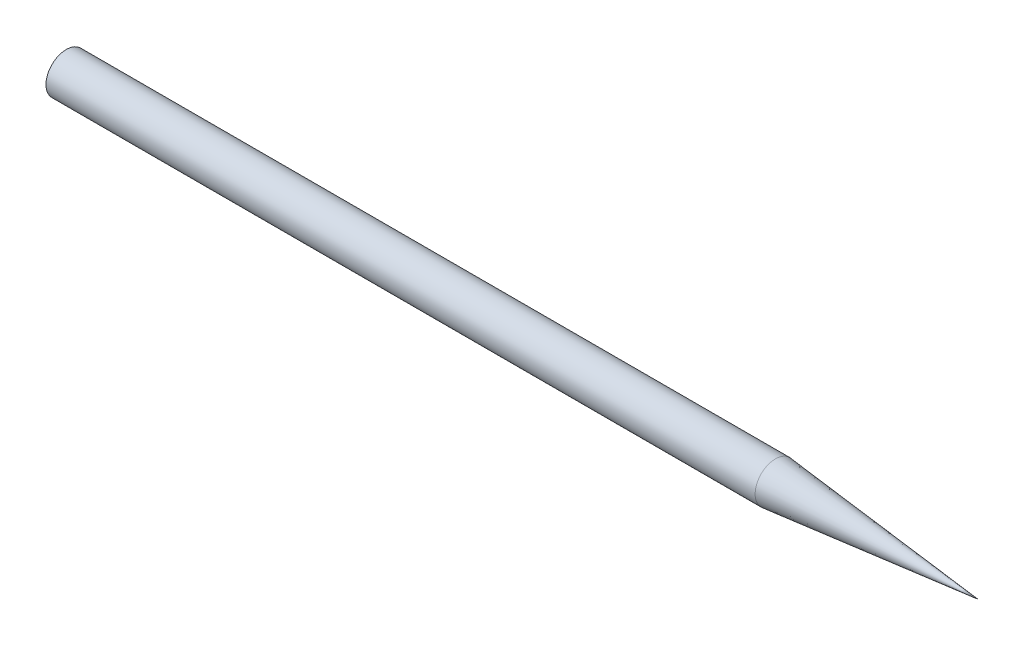
ISO-10303-21;
HEADER;
FILE_DESCRIPTION(('STEP AP214'),'2;1');
FILE_NAME('part.step','',(''),(''),'','','');
FILE_SCHEMA(('AUTOMOTIVE_DESIGN { 1 0 10303 214 1 1 1 1 }'));
ENDSEC;
DATA;
#1=APPLICATION_CONTEXT('core data for automotive mechanical design processes');
#2=APPLICATION_PROTOCOL_DEFINITION('international standard','automotive_design',2000,#1);
#3=PRODUCT_CONTEXT('',#1,'mechanical');
#4=PRODUCT('Part','Part','',(#3));
#5=PRODUCT_RELATED_PRODUCT_CATEGORY('part','',(#4));
#6=PRODUCT_DEFINITION_FORMATION('','',#4);
#7=PRODUCT_DEFINITION_CONTEXT('part definition',#1,'design');
#8=PRODUCT_DEFINITION('design','',#6,#7);
#9=PRODUCT_DEFINITION_SHAPE('','',#8);
#10=(LENGTH_UNIT() NAMED_UNIT(*) SI_UNIT(.MILLI.,.METRE.));
#11=(NAMED_UNIT(*) PLANE_ANGLE_UNIT() SI_UNIT($,.RADIAN.));
#12=(NAMED_UNIT(*) SI_UNIT($,.STERADIAN.) SOLID_ANGLE_UNIT());
#13=UNCERTAINTY_MEASURE_WITH_UNIT(LENGTH_MEASURE(1.E-05),#10,'distance_accuracy_value','');
#14=(GEOMETRIC_REPRESENTATION_CONTEXT(3) GLOBAL_UNCERTAINTY_ASSIGNED_CONTEXT((#13)) GLOBAL_UNIT_ASSIGNED_CONTEXT((#10,
#11,#12)) REPRESENTATION_CONTEXT('',''));
#15=CARTESIAN_POINT('',(0.,0.,0.));
#16=DIRECTION('',(0.,0.,1.));
#17=DIRECTION('',(1.,0.,0.));
#18=AXIS2_PLACEMENT_3D('',#15,#16,#17);
#19=CARTESIAN_POINT('',(-67.5,2.99999999999998,0.));
#20=DIRECTION('',(1.,0.,0.));
#21=DIRECTION('',(0.,1.,0.));
#22=AXIS2_PLACEMENT_3D('',#19,#20,#21);
#23=PLANE('',#22);
#24=CARTESIAN_POINT('',(-67.5,0.,0.));
#25=DIRECTION('',(-1.,0.,0.));
#26=DIRECTION('',(0.,-1.,0.));
#27=AXIS2_PLACEMENT_3D('',#24,#25,#26);
#28=CIRCLE('',#27,2.99999999999998);
#29=CARTESIAN_POINT('',(-67.5,-2.99999999999998,0.));
#30=VERTEX_POINT('',#29);
#31=EDGE_CURVE('E46',#30,#30,#28,.T.);
#32=ORIENTED_EDGE('',*,*,#31,.T.);
#33=EDGE_LOOP('',(#32));
#34=FACE_BOUND('',#33,.T.);
#35=ADVANCED_FACE('F40',(#34),#23,.F.);
#36=CARTESIAN_POINT('',(67.5,0.,0.));
#37=DIRECTION('',(-1.,0.,0.));
#38=DIRECTION('',(0.,-1.,0.));
#39=AXIS2_PLACEMENT_3D('',#36,#37,#38);
#40=CONICAL_SURFACE('',#39,0.,0.0996686524911611);
#41=CARTESIAN_POINT('',(37.5,0.,0.));
#42=DIRECTION('',(-1.,0.,0.));
#43=DIRECTION('',(0.,-1.,0.));
#44=AXIS2_PLACEMENT_3D('',#41,#42,#43);
#45=CIRCLE('',#44,2.99999999999997);
#46=CARTESIAN_POINT('',(37.5,-2.99999999999995,0.));
#47=VERTEX_POINT('',#46);
#48=EDGE_CURVE('E11',#47,#47,#45,.T.);
#49=ORIENTED_EDGE('',*,*,#48,.F.);
#50=EDGE_LOOP('',(#49));
#51=FACE_BOUND('',#50,.T.);
#52=CARTESIAN_POINT('',(67.5,0.,0.));
#53=VERTEX_POINT('',#52);
#54=VERTEX_LOOP('',#53);
#55=FACE_BOUND('',#54,.T.);
#56=ADVANCED_FACE('F49',(#51,#55),#40,.T.);
#57=CARTESIAN_POINT('',(-67.5,0.,0.));
#58=DIRECTION('',(-1.,0.,0.));
#59=DIRECTION('',(0.,-1.,0.));
#60=AXIS2_PLACEMENT_3D('',#57,#58,#59);
#61=CYLINDRICAL_SURFACE('',#60,2.99999999999998);
#62=ORIENTED_EDGE('',*,*,#31,.F.);
#63=EDGE_LOOP('',(#62));
#64=FACE_BOUND('',#63,.T.);
#65=ORIENTED_EDGE('',*,*,#48,.T.);
#66=EDGE_LOOP('',(#65));
#67=FACE_BOUND('',#66,.T.);
#68=ADVANCED_FACE('F51',(#64,#67),#61,.T.);
#69=CLOSED_SHELL('',(#35,#56,#68));
#70=MANIFOLD_SOLID_BREP('B2',#69);
#71=ADVANCED_BREP_SHAPE_REPRESENTATION('',(#18,#70),#14);
#72=SHAPE_DEFINITION_REPRESENTATION(#9,#71);
ENDSEC;
END-ISO-10303-21;
